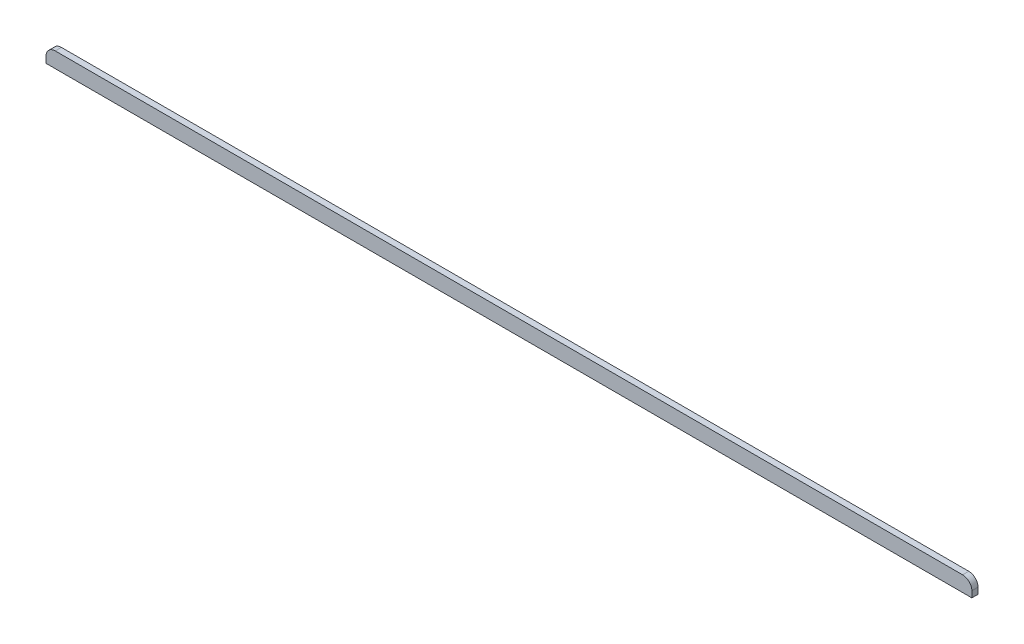
ISO-10303-21;
HEADER;
FILE_DESCRIPTION(('STEP AP214'),'2;1');
FILE_NAME('part.step','',(''),(''),'','','');
FILE_SCHEMA(('AUTOMOTIVE_DESIGN { 1 0 10303 214 1 1 1 1 }'));
ENDSEC;
DATA;
#1=APPLICATION_CONTEXT('core data for automotive mechanical design processes');
#2=APPLICATION_PROTOCOL_DEFINITION('international standard','automotive_design',2000,#1);
#3=PRODUCT_CONTEXT('',#1,'mechanical');
#4=PRODUCT('Part','Part','',(#3));
#5=PRODUCT_RELATED_PRODUCT_CATEGORY('part','',(#4));
#6=PRODUCT_DEFINITION_FORMATION('','',#4);
#7=PRODUCT_DEFINITION_CONTEXT('part definition',#1,'design');
#8=PRODUCT_DEFINITION('design','',#6,#7);
#9=PRODUCT_DEFINITION_SHAPE('','',#8);
#10=(LENGTH_UNIT() NAMED_UNIT(*) SI_UNIT(.MILLI.,.METRE.));
#11=(NAMED_UNIT(*) PLANE_ANGLE_UNIT() SI_UNIT($,.RADIAN.));
#12=(NAMED_UNIT(*) SI_UNIT($,.STERADIAN.) SOLID_ANGLE_UNIT());
#13=UNCERTAINTY_MEASURE_WITH_UNIT(LENGTH_MEASURE(1.E-05),#10,'distance_accuracy_value','');
#14=(GEOMETRIC_REPRESENTATION_CONTEXT(3) GLOBAL_UNCERTAINTY_ASSIGNED_CONTEXT((#13)) GLOBAL_UNIT_ASSIGNED_CONTEXT((#10,
#11,#12)) REPRESENTATION_CONTEXT('',''));
#15=CARTESIAN_POINT('',(0.,0.,0.));
#16=DIRECTION('',(0.,0.,1.));
#17=DIRECTION('',(1.,0.,0.));
#18=AXIS2_PLACEMENT_3D('',#15,#16,#17);
#19=CARTESIAN_POINT('',(-5.,146.,-2.));
#20=DIRECTION('',(-1.,0.,0.));
#21=DIRECTION('',(0.,0.,1.));
#22=AXIS2_PLACEMENT_3D('',#19,#20,#21);
#23=PLANE('',#22);
#24=DIRECTION('',(0.,-1.,0.));
#25=VECTOR('',#24,1.);
#26=CARTESIAN_POINT('',(-5.,146.,0.));
#27=LINE('',#26,#25);
#28=CARTESIAN_POINT('',(-5.,148.,0.));
#29=VERTEX_POINT('',#28);
#30=CARTESIAN_POINT('',(-5.,146.,0.));
#31=VERTEX_POINT('',#30);
#32=EDGE_CURVE('E113',#29,#31,#27,.T.);
#33=ORIENTED_EDGE('',*,*,#32,.F.);
#34=DIRECTION('',(0.,0.,1.));
#35=VECTOR('',#34,1.);
#36=CARTESIAN_POINT('',(-5.,148.,-2.));
#37=LINE('',#36,#35);
#38=CARTESIAN_POINT('',(-5.,148.,-2.));
#39=VERTEX_POINT('',#38);
#40=EDGE_CURVE('E58',#29,#39,#37,.F.);
#41=ORIENTED_EDGE('',*,*,#40,.T.);
#42=DIRECTION('',(0.,-1.,0.));
#43=VECTOR('',#42,1.);
#44=CARTESIAN_POINT('',(-5.,146.,-2.));
#45=LINE('',#44,#43);
#46=CARTESIAN_POINT('',(-5.,146.,-2.));
#47=VERTEX_POINT('',#46);
#48=EDGE_CURVE('E89',#39,#47,#45,.T.);
#49=ORIENTED_EDGE('',*,*,#48,.T.);
#50=DIRECTION('',(0.,0.,1.));
#51=VECTOR('',#50,1.);
#52=CARTESIAN_POINT('',(-5.,146.,-2.));
#53=LINE('',#52,#51);
#54=EDGE_CURVE('E91',#47,#31,#53,.T.);
#55=ORIENTED_EDGE('',*,*,#54,.T.);
#56=EDGE_LOOP('',(#33,#41,#49,#55));
#57=FACE_BOUND('',#56,.T.);
#58=ADVANCED_FACE('F35',(#57),#23,.T.);
#59=CARTESIAN_POINT('',(-5.,151.,-2.));
#60=DIRECTION('',(0.,1.,0.));
#61=DIRECTION('',(0.,0.,1.));
#62=AXIS2_PLACEMENT_3D('',#59,#60,#61);
#63=PLANE('',#62);
#64=DIRECTION('',(-1.,0.,0.));
#65=VECTOR('',#64,1.);
#66=CARTESIAN_POINT('',(-5.,151.,-2.));
#67=LINE('',#66,#65);
#68=CARTESIAN_POINT('',(293.,151.,-2.));
#69=VERTEX_POINT('',#68);
#70=CARTESIAN_POINT('',(-2.,151.,-2.));
#71=VERTEX_POINT('',#70);
#72=EDGE_CURVE('E104',#69,#71,#67,.T.);
#73=ORIENTED_EDGE('',*,*,#72,.T.);
#74=DIRECTION('',(0.,0.,1.));
#75=VECTOR('',#74,1.);
#76=CARTESIAN_POINT('',(-2.,151.,-2.));
#77=LINE('',#76,#75);
#78=CARTESIAN_POINT('',(-2.,151.,0.));
#79=VERTEX_POINT('',#78);
#80=EDGE_CURVE('E124',#71,#79,#77,.T.);
#81=ORIENTED_EDGE('',*,*,#80,.T.);
#82=DIRECTION('',(-1.,0.,0.));
#83=VECTOR('',#82,1.);
#84=CARTESIAN_POINT('',(-5.,151.,0.));
#85=LINE('',#84,#83);
#86=CARTESIAN_POINT('',(293.,151.,0.));
#87=VERTEX_POINT('',#86);
#88=EDGE_CURVE('E96',#87,#79,#85,.T.);
#89=ORIENTED_EDGE('',*,*,#88,.F.);
#90=DIRECTION('',(0.,0.,1.));
#91=VECTOR('',#90,1.);
#92=CARTESIAN_POINT('',(293.,151.,-2.));
#93=LINE('',#92,#91);
#94=EDGE_CURVE('E121',#87,#69,#93,.F.);
#95=ORIENTED_EDGE('',*,*,#94,.T.);
#96=EDGE_LOOP('',(#73,#81,#89,#95));
#97=FACE_BOUND('',#96,.T.);
#98=ADVANCED_FACE('F135',(#97),#63,.T.);
#99=CARTESIAN_POINT('',(296.,146.,-2.));
#100=DIRECTION('',(1.,0.,0.));
#101=DIRECTION('',(0.,0.,-1.));
#102=AXIS2_PLACEMENT_3D('',#99,#100,#101);
#103=PLANE('',#102);
#104=DIRECTION('',(0.,1.,0.));
#105=VECTOR('',#104,1.);
#106=CARTESIAN_POINT('',(296.,146.,-2.));
#107=LINE('',#106,#105);
#108=CARTESIAN_POINT('',(296.,146.,-2.));
#109=VERTEX_POINT('',#108);
#110=CARTESIAN_POINT('',(296.,148.,-2.));
#111=VERTEX_POINT('',#110);
#112=EDGE_CURVE('E107',#109,#111,#107,.T.);
#113=ORIENTED_EDGE('',*,*,#112,.T.);
#114=DIRECTION('',(0.,0.,1.));
#115=VECTOR('',#114,1.);
#116=CARTESIAN_POINT('',(296.,148.,-2.));
#117=LINE('',#116,#115);
#118=CARTESIAN_POINT('',(296.,148.,0.));
#119=VERTEX_POINT('',#118);
#120=EDGE_CURVE('E11',#111,#119,#117,.T.);
#121=ORIENTED_EDGE('',*,*,#120,.T.);
#122=DIRECTION('',(0.,1.,0.));
#123=VECTOR('',#122,1.);
#124=CARTESIAN_POINT('',(296.,146.,0.));
#125=LINE('',#124,#123);
#126=CARTESIAN_POINT('',(296.,146.,0.));
#127=VERTEX_POINT('',#126);
#128=EDGE_CURVE('E116',#127,#119,#125,.T.);
#129=ORIENTED_EDGE('',*,*,#128,.F.);
#130=DIRECTION('',(0.,0.,1.));
#131=VECTOR('',#130,1.);
#132=CARTESIAN_POINT('',(296.,146.,-2.));
#133=LINE('',#132,#131);
#134=EDGE_CURVE('E103',#109,#127,#133,.T.);
#135=ORIENTED_EDGE('',*,*,#134,.F.);
#136=EDGE_LOOP('',(#113,#121,#129,#135));
#137=FACE_BOUND('',#136,.T.);
#138=ADVANCED_FACE('F145',(#137),#103,.T.);
#139=CARTESIAN_POINT('',(-5.,146.,-2.));
#140=DIRECTION('',(0.,-1.,0.));
#141=DIRECTION('',(0.,0.,-1.));
#142=AXIS2_PLACEMENT_3D('',#139,#140,#141);
#143=PLANE('',#142);
#144=DIRECTION('',(1.,0.,0.));
#145=VECTOR('',#144,1.);
#146=CARTESIAN_POINT('',(-5.,146.,0.));
#147=LINE('',#146,#145);
#148=EDGE_CURVE('E102',#31,#127,#147,.T.);
#149=ORIENTED_EDGE('',*,*,#148,.F.);
#150=ORIENTED_EDGE('',*,*,#54,.F.);
#151=DIRECTION('',(1.,0.,0.));
#152=VECTOR('',#151,1.);
#153=CARTESIAN_POINT('',(-5.,146.,-2.));
#154=LINE('',#153,#152);
#155=EDGE_CURVE('E95',#47,#109,#154,.T.);
#156=ORIENTED_EDGE('',*,*,#155,.T.);
#157=ORIENTED_EDGE('',*,*,#134,.T.);
#158=EDGE_LOOP('',(#149,#150,#156,#157));
#159=FACE_BOUND('',#158,.T.);
#160=ADVANCED_FACE('F100',(#159),#143,.T.);
#161=CARTESIAN_POINT('',(0.,0.,-2.));
#162=DIRECTION('',(0.,0.,-1.));
#163=DIRECTION('',(-1.,0.,0.));
#164=AXIS2_PLACEMENT_3D('',#161,#162,#163);
#165=PLANE('',#164);
#166=ORIENTED_EDGE('',*,*,#48,.F.);
#167=CARTESIAN_POINT('',(-2.,148.,-2.));
#168=DIRECTION('',(0.,0.,-1.));
#169=DIRECTION('',(-1.,0.,0.));
#170=AXIS2_PLACEMENT_3D('',#167,#168,#169);
#171=CIRCLE('',#170,3.);
#172=EDGE_CURVE('E43',#39,#71,#171,.T.);
#173=ORIENTED_EDGE('',*,*,#172,.T.);
#174=ORIENTED_EDGE('',*,*,#72,.F.);
#175=CARTESIAN_POINT('',(293.,148.,-2.));
#176=DIRECTION('',(0.,0.,-1.));
#177=DIRECTION('',(-1.,0.,0.));
#178=AXIS2_PLACEMENT_3D('',#175,#176,#177);
#179=CIRCLE('',#178,3.);
#180=EDGE_CURVE('E50',#69,#111,#179,.T.);
#181=ORIENTED_EDGE('',*,*,#180,.T.);
#182=ORIENTED_EDGE('',*,*,#112,.F.);
#183=ORIENTED_EDGE('',*,*,#155,.F.);
#184=EDGE_LOOP('',(#166,#173,#174,#181,#182,#183));
#185=FACE_BOUND('',#184,.T.);
#186=ADVANCED_FACE('F106',(#185),#165,.T.);
#187=CARTESIAN_POINT('',(0.,0.,0.));
#188=DIRECTION('',(0.,0.,-1.));
#189=DIRECTION('',(-1.,0.,0.));
#190=AXIS2_PLACEMENT_3D('',#187,#188,#189);
#191=PLANE('',#190);
#192=ORIENTED_EDGE('',*,*,#88,.T.);
#193=CARTESIAN_POINT('',(-2.,148.,0.));
#194=DIRECTION('',(0.,0.,-1.));
#195=DIRECTION('',(-1.,0.,0.));
#196=AXIS2_PLACEMENT_3D('',#193,#194,#195);
#197=CIRCLE('',#196,3.);
#198=EDGE_CURVE('E129',#79,#29,#197,.F.);
#199=ORIENTED_EDGE('',*,*,#198,.T.);
#200=ORIENTED_EDGE('',*,*,#32,.T.);
#201=ORIENTED_EDGE('',*,*,#148,.T.);
#202=ORIENTED_EDGE('',*,*,#128,.T.);
#203=CARTESIAN_POINT('',(293.,148.,0.));
#204=DIRECTION('',(0.,0.,-1.));
#205=DIRECTION('',(-1.,0.,0.));
#206=AXIS2_PLACEMENT_3D('',#203,#204,#205);
#207=CIRCLE('',#206,3.);
#208=EDGE_CURVE('E127',#119,#87,#207,.F.);
#209=ORIENTED_EDGE('',*,*,#208,.T.);
#210=EDGE_LOOP('',(#192,#199,#200,#201,#202,#209));
#211=FACE_BOUND('',#210,.T.);
#212=ADVANCED_FACE('F140',(#211),#191,.F.);
#213=CARTESIAN_POINT('',(-2.,148.,-2.));
#214=DIRECTION('',(0.,0.,1.));
#215=DIRECTION('',(1.,0.,0.));
#216=AXIS2_PLACEMENT_3D('',#213,#214,#215);
#217=CYLINDRICAL_SURFACE('',#216,3.);
#218=ORIENTED_EDGE('',*,*,#172,.F.);
#219=ORIENTED_EDGE('',*,*,#40,.F.);
#220=ORIENTED_EDGE('',*,*,#198,.F.);
#221=ORIENTED_EDGE('',*,*,#80,.F.);
#222=EDGE_LOOP('',(#218,#219,#220,#221));
#223=FACE_BOUND('',#222,.T.);
#224=ADVANCED_FACE('F138',(#223),#217,.T.);
#225=CARTESIAN_POINT('',(293.,148.,-2.));
#226=DIRECTION('',(0.,0.,1.));
#227=DIRECTION('',(1.,0.,0.));
#228=AXIS2_PLACEMENT_3D('',#225,#226,#227);
#229=CYLINDRICAL_SURFACE('',#228,3.);
#230=ORIENTED_EDGE('',*,*,#180,.F.);
#231=ORIENTED_EDGE('',*,*,#94,.F.);
#232=ORIENTED_EDGE('',*,*,#208,.F.);
#233=ORIENTED_EDGE('',*,*,#120,.F.);
#234=EDGE_LOOP('',(#230,#231,#232,#233));
#235=FACE_BOUND('',#234,.T.);
#236=ADVANCED_FACE('F37',(#235),#229,.T.);
#237=CLOSED_SHELL('',(#58,#98,#138,#160,#186,#212,#224,#236));
#238=MANIFOLD_SOLID_BREP('B2',#237);
#239=ADVANCED_BREP_SHAPE_REPRESENTATION('',(#18,#238),#14);
#240=SHAPE_DEFINITION_REPRESENTATION(#9,#239);
ENDSEC;
END-ISO-10303-21;
